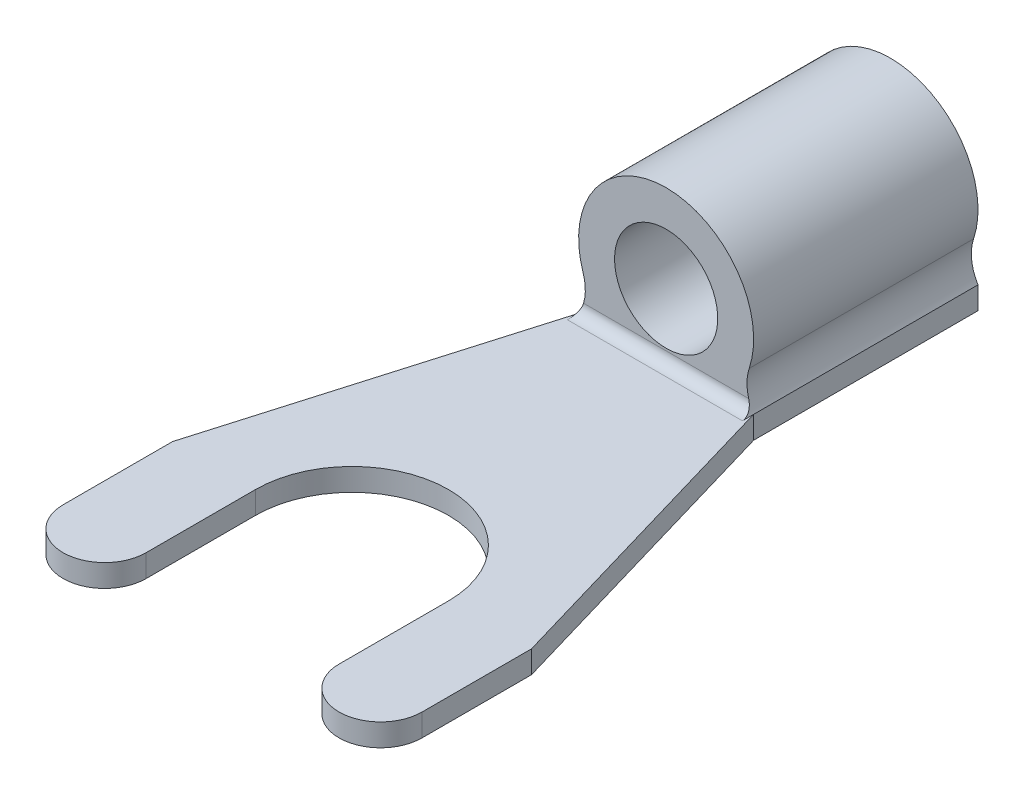
ISO-10303-21;
HEADER;
FILE_DESCRIPTION(('STEP AP214'),'2;1');
FILE_NAME('part.step','',(''),(''),'','','');
FILE_SCHEMA(('AUTOMOTIVE_DESIGN { 1 0 10303 214 1 1 1 1 }'));
ENDSEC;
DATA;
#1=APPLICATION_CONTEXT('core data for automotive mechanical design processes');
#2=APPLICATION_PROTOCOL_DEFINITION('international standard','automotive_design',2000,#1);
#3=PRODUCT_CONTEXT('',#1,'mechanical');
#4=PRODUCT('Part','Part','',(#3));
#5=PRODUCT_RELATED_PRODUCT_CATEGORY('part','',(#4));
#6=PRODUCT_DEFINITION_FORMATION('','',#4);
#7=PRODUCT_DEFINITION_CONTEXT('part definition',#1,'design');
#8=PRODUCT_DEFINITION('design','',#6,#7);
#9=PRODUCT_DEFINITION_SHAPE('','',#8);
#10=(LENGTH_UNIT() NAMED_UNIT(*) SI_UNIT(.MILLI.,.METRE.));
#11=(NAMED_UNIT(*) PLANE_ANGLE_UNIT() SI_UNIT($,.RADIAN.));
#12=(NAMED_UNIT(*) SI_UNIT($,.STERADIAN.) SOLID_ANGLE_UNIT());
#13=UNCERTAINTY_MEASURE_WITH_UNIT(LENGTH_MEASURE(1.E-05),#10,'distance_accuracy_value','');
#14=(GEOMETRIC_REPRESENTATION_CONTEXT(3) GLOBAL_UNCERTAINTY_ASSIGNED_CONTEXT((#13)) GLOBAL_UNIT_ASSIGNED_CONTEXT((#10,
#11,#12)) REPRESENTATION_CONTEXT('',''));
#15=CARTESIAN_POINT('',(0.,0.,0.));
#16=DIRECTION('',(0.,0.,1.));
#17=DIRECTION('',(1.,0.,0.));
#18=AXIS2_PLACEMENT_3D('',#15,#16,#17);
#19=CARTESIAN_POINT('',(-14.9500000000012,9.13000000000002,182.5));
#20=DIRECTION('',(-1.,0.,0.));
#21=DIRECTION('',(0.,0.,1.));
#22=AXIS2_PLACEMENT_3D('',#19,#20,#21);
#23=CYLINDRICAL_SURFACE('',#22,0.25);
#24=DIRECTION('',(-1.,0.,0.));
#25=VECTOR('',#24,1.);
#26=CARTESIAN_POINT('',(-14.9500000000012,9.13000000000002,182.25));
#27=LINE('',#26,#25);
#28=CARTESIAN_POINT('',(-13.1102982723098,9.13,182.25));
#29=VERTEX_POINT('',#28);
#30=CARTESIAN_POINT('',(-16.7897017276926,9.13000000000003,182.25));
#31=VERTEX_POINT('',#30);
#32=EDGE_CURVE('E155',#29,#31,#27,.T.);
#33=ORIENTED_EDGE('',*,*,#32,.T.);
#34=CARTESIAN_POINT('',(-16.9000000000012,8.88000000000003,182.5));
#35=CARTESIAN_POINT('',(-16.9000185220182,8.87998350208191,182.4872073478));
#36=CARTESIAN_POINT('',(-16.8993951977265,8.88098059979648,182.474436694274));
#37=CARTESIAN_POINT('',(-16.8970172730689,8.88485973144562,182.449364531361));
#38=CARTESIAN_POINT('',(-16.8952691101724,8.88773104058074,182.437060771608));
#39=CARTESIAN_POINT('',(-16.8907945553141,8.8952129119025,182.413214396754));
#40=CARTESIAN_POINT('',(-16.8880698056136,8.8998205548764,182.401670542118));
#41=CARTESIAN_POINT('',(-16.8818583154234,8.91058840206375,182.379542131342));
#42=CARTESIAN_POINT('',(-16.8783705728291,8.91675064972032,182.368958862934));
#43=CARTESIAN_POINT('',(-16.8705720409435,8.93095510962607,182.348173131809));
#44=CARTESIAN_POINT('',(-16.8662189837371,8.93910416134594,182.338059806611));
#45=CARTESIAN_POINT('',(-16.8571470031596,8.95676407682092,182.319291597628));
#46=CARTESIAN_POINT('',(-16.8524279042634,8.9662755957837,182.310637419929));
#47=CARTESIAN_POINT('',(-16.8422376060457,8.98776413334577,182.293899574314));
#48=CARTESIAN_POINT('',(-16.8367476004056,8.99990090788977,182.286031604488));
#49=CARTESIAN_POINT('',(-16.8258828243351,9.02538110219441,182.272485139351));
#50=CARTESIAN_POINT('',(-16.8205080070898,9.0387240197901,182.266805737989));
#51=CARTESIAN_POINT('',(-16.8106634813175,9.06487556374363,182.258282404753));
#52=CARTESIAN_POINT('',(-16.8061578831346,9.07759431701481,182.255204187879));
#53=CARTESIAN_POINT('',(-16.7975729816935,9.10350873376382,182.251059775299));
#54=CARTESIAN_POINT('',(-16.7934941515171,9.11670490512104,182.249995790551));
#55=CARTESIAN_POINT('',(-16.7897017276926,9.13000000000003,182.25));
#56=B_SPLINE_CURVE_WITH_KNOTS('',3,(#34,#35,#36,#37,#38,#39,#40,#41,#42,#43,#44,#45,#46,#47,#48,
#49,#50,#51,#52,#53,#54,#55),.UNSPECIFIED.,.F.,.F.,(4,2,2,2,2,2,2,2,2,2,4),(0.,
0.0382893069018446,0.0763614093332984,0.11436978653352,0.152428386377286,0.193361552979218,
0.234314470757116,0.28052232594922,0.326711030823076,0.368073046255073,0.409480437175439),.UNSPECIFIED.);
#57=CARTESIAN_POINT('',(-16.9000000000012,8.88000000000003,182.5));
#58=VERTEX_POINT('',#57);
#59=EDGE_CURVE('E40',#58,#31,#56,.T.);
#60=ORIENTED_EDGE('',*,*,#59,.F.);
#61=DIRECTION('',(1.,0.,0.));
#62=VECTOR('',#61,1.);
#63=CARTESIAN_POINT('',(-14.9500000000012,8.88000000000002,182.5));
#64=LINE('',#63,#62);
#65=CARTESIAN_POINT('',(-13.0000000000012,8.88,182.5));
#66=VERTEX_POINT('',#65);
#67=EDGE_CURVE('E152',#66,#58,#64,.F.);
#68=ORIENTED_EDGE('',*,*,#67,.F.);
#69=CARTESIAN_POINT('',(-13.1102982723098,9.13,182.25));
#70=CARTESIAN_POINT('',(-13.1060596798824,9.11512779679029,182.249993478925));
#71=CARTESIAN_POINT('',(-13.1014586294552,9.10038265994374,182.251325725585));
#72=CARTESIAN_POINT('',(-13.0917498699775,9.07155076728541,182.256491089866));
#73=CARTESIAN_POINT('',(-13.0866435145946,9.05746239360386,182.260317671396));
#74=CARTESIAN_POINT('',(-13.0761246940504,9.03028378413502,182.270290573388));
#75=CARTESIAN_POINT('',(-13.0707126184818,9.01719232577841,182.276433995671));
#76=CARTESIAN_POINT('',(-13.0598278133018,8.99226303979226,182.29086820397));
#77=CARTESIAN_POINT('',(-13.054355032871,8.98042636646853,182.299160943449));
#78=CARTESIAN_POINT('',(-13.0434334200001,8.95785141296547,182.318092214721));
#79=CARTESIAN_POINT('',(-13.037994126214,8.94717522708283,182.328810665518));
#80=CARTESIAN_POINT('',(-13.0277553318681,8.92780780539204,182.352187869189));
#81=CARTESIAN_POINT('',(-13.0229557967466,8.91911646233858,182.364846517168));
#82=CARTESIAN_POINT('',(-13.0146389486618,8.90444903830031,182.391175058417));
#83=CARTESIAN_POINT('',(-13.0110709798096,8.89836226630808,182.404766791729));
#84=CARTESIAN_POINT('',(-13.0053033009057,8.88866779343421,182.433062174529));
#85=CARTESIAN_POINT('',(-13.0030994657548,8.88505261502826,182.447762319456));
#86=CARTESIAN_POINT('',(-13.0011486699751,8.88186651093653,182.468873732107));
#87=CARTESIAN_POINT('',(-13.0007191109057,8.88116761544177,182.475071014027));
#88=CARTESIAN_POINT('',(-13.000144668019,8.88023447331087,182.487510768612));
#89=CARTESIAN_POINT('',(-12.9999996593873,8.88000002295155,182.493753220259));
#90=CARTESIAN_POINT('',(-13.0000000000012,8.88,182.5));
#91=B_SPLINE_CURVE_WITH_KNOTS('',3,(#69,#70,#71,#72,#73,#74,#75,#76,#77,#78,#79,#80,#81,#82,#83,
#84,#85,#86,#87,#88,#89,#90),.UNSPECIFIED.,.F.,.F.,(4,2,2,2,2,2,2,2,2,2,4),(0.,
0.0462989373863143,0.0924770392758468,0.138597566715191,0.18476015989698,0.232751610935645,
0.28074046827986,0.326416072227285,0.371952870975017,0.390686940772978,0.409412791278981),.UNSPECIFIED.);
#92=EDGE_CURVE('E160',#29,#66,#91,.T.);
#93=ORIENTED_EDGE('',*,*,#92,.F.);
#94=EDGE_LOOP('',(#33,#60,#68,#93));
#95=FACE_BOUND('',#94,.T.);
#96=ADVANCED_FACE('F36',(#95),#23,.F.);
#97=CARTESIAN_POINT('',(-14.9500000000012,10.33,182.25));
#98=DIRECTION('',(0.,0.,-1.));
#99=DIRECTION('',(-1.,0.,0.));
#100=AXIS2_PLACEMENT_3D('',#97,#98,#99);
#101=CYLINDRICAL_SURFACE('',#100,1.15);
#102=CARTESIAN_POINT('',(-14.9500000000012,10.33,177.600000000025));
#103=DIRECTION('',(0.,0.,-1.));
#104=DIRECTION('',(-1.,0.,0.));
#105=AXIS2_PLACEMENT_3D('',#102,#103,#104);
#106=CIRCLE('',#105,1.14999999999554);
#107=CARTESIAN_POINT('',(-16.0999999999967,10.33,177.600000000025));
#108=VERTEX_POINT('',#107);
#109=EDGE_CURVE('E244',#108,#108,#106,.T.);
#110=ORIENTED_EDGE('',*,*,#109,.T.);
#111=EDGE_LOOP('',(#110));
#112=FACE_BOUND('',#111,.T.);
#113=CARTESIAN_POINT('',(-14.9500000000012,10.33,182.25));
#114=DIRECTION('',(0.,0.,-1.));
#115=DIRECTION('',(-1.,0.,0.));
#116=AXIS2_PLACEMENT_3D('',#113,#114,#115);
#117=CIRCLE('',#116,1.15);
#118=CARTESIAN_POINT('',(-16.1000000000012,10.33,182.25));
#119=VERTEX_POINT('',#118);
#120=EDGE_CURVE('E170',#119,#119,#117,.F.);
#121=ORIENTED_EDGE('',*,*,#120,.T.);
#122=EDGE_LOOP('',(#121));
#123=FACE_BOUND('',#122,.T.);
#124=ADVANCED_FACE('F297',(#112,#123),#101,.F.);
#125=CARTESIAN_POINT('',(-14.9500000000012,10.33,182.25));
#126=DIRECTION('',(0.,0.,-1.));
#127=DIRECTION('',(-1.,0.,0.));
#128=AXIS2_PLACEMENT_3D('',#125,#126,#127);
#129=PLANE('',#128);
#130=ORIENTED_EDGE('',*,*,#120,.F.);
#131=EDGE_LOOP('',(#130));
#132=FACE_BOUND('',#131,.T.);
#133=ORIENTED_EDGE('',*,*,#32,.F.);
#134=CARTESIAN_POINT('',(-12.1488162453612,9.40486780796407,182.25));
#135=DIRECTION('',(0.,0.,1.));
#136=DIRECTION('',(1.,0.,0.));
#137=AXIS2_PLACEMENT_3D('',#134,#135,#136);
#138=CIRCLE('',#137,1.);
#139=CARTESIAN_POINT('',(-13.0983700604934,9.71847194085761,182.25));
#140=VERTEX_POINT('',#139);
#141=EDGE_CURVE('E211',#29,#140,#138,.F.);
#142=ORIENTED_EDGE('',*,*,#141,.T.);
#143=CARTESIAN_POINT('',(-14.9500000000012,10.33,182.25));
#144=DIRECTION('',(0.,0.,-1.));
#145=DIRECTION('',(-1.,0.,0.));
#146=AXIS2_PLACEMENT_3D('',#143,#144,#145);
#147=CIRCLE('',#146,1.95);
#148=CARTESIAN_POINT('',(-16.801629939509,9.71847194085765,182.25));
#149=VERTEX_POINT('',#148);
#150=EDGE_CURVE('E181',#149,#140,#147,.T.);
#151=ORIENTED_EDGE('',*,*,#150,.F.);
#152=CARTESIAN_POINT('',(-17.7511837546411,9.40486780796412,182.25));
#153=DIRECTION('',(0.,0.,-1.));
#154=DIRECTION('',(-1.,0.,0.));
#155=AXIS2_PLACEMENT_3D('',#152,#153,#154);
#156=CIRCLE('',#155,1.);
#157=EDGE_CURVE('E243',#31,#149,#156,.F.);
#158=ORIENTED_EDGE('',*,*,#157,.F.);
#159=EDGE_LOOP('',(#133,#142,#151,#158));
#160=FACE_BOUND('',#159,.T.);
#161=ADVANCED_FACE('F295',(#132,#160),#129,.F.);
#162=CARTESIAN_POINT('',(-14.9500000000012,8.88000000000002,189.25));
#163=DIRECTION('',(0.,1.,0.));
#164=DIRECTION('',(1.,0.,0.));
#165=AXIS2_PLACEMENT_3D('',#162,#163,#164);
#166=PLANE('',#165);
#167=DIRECTION('',(0.281052751161889,0.,0.959692321040621));
#168=VECTOR('',#167,1.);
#169=CARTESIAN_POINT('',(-11.2659625957439,8.87999999999998,188.17110333161));
#170=LINE('',#169,#168);
#171=CARTESIAN_POINT('',(-10.9500000000012,8.87999999999998,189.25));
#172=VERTEX_POINT('',#171);
#173=CARTESIAN_POINT('',(-13.0000000000012,8.88,182.25));
#174=VERTEX_POINT('',#173);
#175=EDGE_CURVE('E217',#172,#174,#170,.F.);
#176=ORIENTED_EDGE('',*,*,#175,.T.);
#177=DIRECTION('',(0.,0.,1.));
#178=VECTOR('',#177,1.);
#179=CARTESIAN_POINT('',(-13.0000000000012,8.88,189.25));
#180=LINE('',#179,#178);
#181=EDGE_CURVE('E168',#174,#66,#180,.T.);
#182=ORIENTED_EDGE('',*,*,#181,.T.);
#183=ORIENTED_EDGE('',*,*,#67,.T.);
#184=DIRECTION('',(0.,0.,-1.));
#185=VECTOR('',#184,1.);
#186=CARTESIAN_POINT('',(-16.9000000000012,8.88000000000003,189.25));
#187=LINE('',#186,#185);
#188=CARTESIAN_POINT('',(-16.9000000000012,8.88000000000003,182.25));
#189=VERTEX_POINT('',#188);
#190=EDGE_CURVE('E166',#58,#189,#187,.T.);
#191=ORIENTED_EDGE('',*,*,#190,.T.);
#192=DIRECTION('',(0.281052751161902,0.,-0.959692321040617));
#193=VECTOR('',#192,1.);
#194=CARTESIAN_POINT('',(-18.6340374042586,8.88000000000005,188.17110333161));
#195=LINE('',#194,#193);
#196=CARTESIAN_POINT('',(-18.9500000000012,8.88000000000005,189.25));
#197=VERTEX_POINT('',#196);
#198=EDGE_CURVE('E175',#189,#197,#195,.F.);
#199=ORIENTED_EDGE('',*,*,#198,.T.);
#200=DIRECTION('',(0.,0.,1.));
#201=VECTOR('',#200,1.);
#202=CARTESIAN_POINT('',(-18.9500000000012,8.88000000000005,189.25));
#203=LINE('',#202,#201);
#204=CARTESIAN_POINT('',(-18.9500000000013,8.88000000000005,191.68926218353));
#205=VERTEX_POINT('',#204);
#206=EDGE_CURVE('E178',#205,#197,#203,.F.);
#207=ORIENTED_EDGE('',*,*,#206,.F.);
#208=CARTESIAN_POINT('',(-18.0250000000013,8.88000000000004,191.68926218353));
#209=DIRECTION('',(0.,-1.,0.));
#210=DIRECTION('',(-1.,0.,0.));
#211=AXIS2_PLACEMENT_3D('',#208,#209,#210);
#212=CIRCLE('',#211,0.925);
#213=CARTESIAN_POINT('',(-17.1000000000013,8.88000000000004,191.68926218353));
#214=VERTEX_POINT('',#213);
#215=EDGE_CURVE('E273',#214,#205,#212,.T.);
#216=ORIENTED_EDGE('',*,*,#215,.F.);
#217=DIRECTION('',(0.,0.,-1.));
#218=VECTOR('',#217,1.);
#219=CARTESIAN_POINT('',(-17.1000000000012,8.88000000000004,189.25));
#220=LINE('',#219,#218);
#221=CARTESIAN_POINT('',(-17.1000000000012,8.88000000000004,189.25));
#222=VERTEX_POINT('',#221);
#223=EDGE_CURVE('E234',#222,#214,#220,.F.);
#224=ORIENTED_EDGE('',*,*,#223,.F.);
#225=CARTESIAN_POINT('',(-14.9500000000012,8.88000000000002,189.25));
#226=DIRECTION('',(0.,-1.,0.));
#227=DIRECTION('',(-1.,0.,0.));
#228=AXIS2_PLACEMENT_3D('',#225,#226,#227);
#229=CIRCLE('',#228,2.15);
#230=CARTESIAN_POINT('',(-12.8000000000013,8.88,189.25));
#231=VERTEX_POINT('',#230);
#232=EDGE_CURVE('E270',#222,#231,#229,.T.);
#233=ORIENTED_EDGE('',*,*,#232,.T.);
#234=DIRECTION('',(0.,0.,-1.));
#235=VECTOR('',#234,1.);
#236=CARTESIAN_POINT('',(-12.8000000000013,8.88,189.25));
#237=LINE('',#236,#235);
#238=CARTESIAN_POINT('',(-12.8000000000013,8.88,191.68926218353));
#239=VERTEX_POINT('',#238);
#240=EDGE_CURVE('E229',#231,#239,#237,.F.);
#241=ORIENTED_EDGE('',*,*,#240,.T.);
#242=CARTESIAN_POINT('',(-11.8750000000013,8.87999999999999,191.68926218353));
#243=DIRECTION('',(0.,-1.,0.));
#244=DIRECTION('',(-1.,0.,0.));
#245=AXIS2_PLACEMENT_3D('',#242,#243,#244);
#246=CIRCLE('',#245,0.925);
#247=CARTESIAN_POINT('',(-10.9500000000013,8.87999999999998,191.68926218353));
#248=VERTEX_POINT('',#247);
#249=EDGE_CURVE('E232',#248,#239,#246,.T.);
#250=ORIENTED_EDGE('',*,*,#249,.F.);
#251=DIRECTION('',(0.,0.,1.));
#252=VECTOR('',#251,1.);
#253=CARTESIAN_POINT('',(-10.9500000000012,8.87999999999998,189.25));
#254=LINE('',#253,#252);
#255=EDGE_CURVE('E224',#248,#172,#254,.F.);
#256=ORIENTED_EDGE('',*,*,#255,.T.);
#257=EDGE_LOOP('',(#176,#182,#183,#191,#199,#207,#216,#224,#233,#241,#250,#256));
#258=FACE_BOUND('',#257,.T.);
#259=ADVANCED_FACE('F164',(#258),#166,.T.);
#260=CARTESIAN_POINT('',(-12.1488162453613,9.40486780796407,189.25));
#261=DIRECTION('',(0.,0.,1.));
#262=DIRECTION('',(1.,0.,0.));
#263=AXIS2_PLACEMENT_3D('',#260,#261,#262);
#264=CYLINDRICAL_SURFACE('',#263,1.);
#265=ORIENTED_EDGE('',*,*,#92,.T.);
#266=ORIENTED_EDGE('',*,*,#181,.F.);
#267=DIRECTION('',(0.,0.,1.));
#268=VECTOR('',#267,1.);
#269=CARTESIAN_POINT('',(-13.0000000000012,8.88,189.25));
#270=LINE('',#269,#268);
#271=CARTESIAN_POINT('',(-13.0000000000011,8.88,177.25));
#272=VERTEX_POINT('',#271);
#273=EDGE_CURVE('E198',#174,#272,#270,.F.);
#274=ORIENTED_EDGE('',*,*,#273,.T.);
#275=CARTESIAN_POINT('',(-12.1488162453612,9.40486780796407,177.25));
#276=DIRECTION('',(0.,0.,1.));
#277=DIRECTION('',(1.,0.,0.));
#278=AXIS2_PLACEMENT_3D('',#275,#276,#277);
#279=CIRCLE('',#278,1.);
#280=CARTESIAN_POINT('',(-13.0983700604934,9.71847194085761,177.25));
#281=VERTEX_POINT('',#280);
#282=EDGE_CURVE('E212',#281,#272,#279,.T.);
#283=ORIENTED_EDGE('',*,*,#282,.F.);
#284=DIRECTION('',(0.,0.,1.));
#285=VECTOR('',#284,1.);
#286=CARTESIAN_POINT('',(-13.0983700604935,9.71847194085761,189.25));
#287=LINE('',#286,#285);
#288=EDGE_CURVE('E169',#140,#281,#287,.F.);
#289=ORIENTED_EDGE('',*,*,#288,.F.);
#290=ORIENTED_EDGE('',*,*,#141,.F.);
#291=EDGE_LOOP('',(#265,#266,#274,#283,#289,#290));
#292=FACE_BOUND('',#291,.T.);
#293=ADVANCED_FACE('F285',(#292),#264,.F.);
#294=CARTESIAN_POINT('',(-14.9500000000011,10.33,177.250000000056));
#295=DIRECTION('',(0.,0.,-1.));
#296=DIRECTION('',(-1.,0.,0.));
#297=AXIS2_PLACEMENT_3D('',#294,#295,#296);
#298=CONICAL_SURFACE('',#297,1.49999999996453,0.785398163397448);
#299=CARTESIAN_POINT('',(-14.9500000000011,10.33,177.249999999999));
#300=DIRECTION('',(0.,0.,-1.));
#301=DIRECTION('',(-1.,0.,0.));
#302=AXIS2_PLACEMENT_3D('',#299,#300,#301);
#303=CIRCLE('',#302,1.50000000002137);
#304=CARTESIAN_POINT('',(-16.4500000000225,10.33,177.249999999999));
#305=VERTEX_POINT('',#304);
#306=EDGE_CURVE('E201',#305,#305,#303,.T.);
#307=ORIENTED_EDGE('',*,*,#306,.T.);
#308=EDGE_LOOP('',(#307));
#309=FACE_BOUND('',#308,.T.);
#310=ORIENTED_EDGE('',*,*,#109,.F.);
#311=EDGE_LOOP('',(#310));
#312=FACE_BOUND('',#311,.T.);
#313=ADVANCED_FACE('F290',(#309,#312),#298,.F.);
#314=CARTESIAN_POINT('',(-14.9500000000012,10.33,182.25));
#315=DIRECTION('',(0.,0.,-1.));
#316=DIRECTION('',(-1.,0.,0.));
#317=AXIS2_PLACEMENT_3D('',#314,#315,#316);
#318=CYLINDRICAL_SURFACE('',#317,1.95);
#319=CARTESIAN_POINT('',(-14.9500000000011,10.33,177.25));
#320=DIRECTION('',(0.,0.,-1.));
#321=DIRECTION('',(-1.,0.,0.));
#322=AXIS2_PLACEMENT_3D('',#319,#320,#321);
#323=CIRCLE('',#322,1.95);
#324=CARTESIAN_POINT('',(-16.8016299395089,9.71847194085765,177.25));
#325=VERTEX_POINT('',#324);
#326=EDGE_CURVE('E263',#281,#325,#323,.F.);
#327=ORIENTED_EDGE('',*,*,#326,.T.);
#328=DIRECTION('',(0.,0.,-1.));
#329=VECTOR('',#328,1.);
#330=CARTESIAN_POINT('',(-16.801629939509,9.71847194085765,189.25));
#331=LINE('',#330,#329);
#332=EDGE_CURVE('E176',#325,#149,#331,.F.);
#333=ORIENTED_EDGE('',*,*,#332,.T.);
#334=ORIENTED_EDGE('',*,*,#150,.T.);
#335=ORIENTED_EDGE('',*,*,#288,.T.);
#336=EDGE_LOOP('',(#327,#333,#334,#335));
#337=FACE_BOUND('',#336,.T.);
#338=ADVANCED_FACE('F361',(#337),#318,.T.);
#339=CARTESIAN_POINT('',(-17.7511837546412,9.40486780796412,189.25));
#340=DIRECTION('',(0.,0.,-1.));
#341=DIRECTION('',(-1.,0.,0.));
#342=AXIS2_PLACEMENT_3D('',#339,#340,#341);
#343=CYLINDRICAL_SURFACE('',#342,1.);
#344=DIRECTION('',(0.,0.,-1.));
#345=VECTOR('',#344,1.);
#346=CARTESIAN_POINT('',(-16.9000000000012,8.88000000000003,189.25));
#347=LINE('',#346,#345);
#348=CARTESIAN_POINT('',(-16.9000000000012,8.88000000000003,177.25));
#349=VERTEX_POINT('',#348);
#350=EDGE_CURVE('E174',#349,#189,#347,.F.);
#351=ORIENTED_EDGE('',*,*,#350,.T.);
#352=ORIENTED_EDGE('',*,*,#190,.F.);
#353=ORIENTED_EDGE('',*,*,#59,.T.);
#354=ORIENTED_EDGE('',*,*,#157,.T.);
#355=ORIENTED_EDGE('',*,*,#332,.F.);
#356=CARTESIAN_POINT('',(-17.7511837546411,9.40486780796412,177.25));
#357=DIRECTION('',(0.,0.,-1.));
#358=DIRECTION('',(-1.,0.,0.));
#359=AXIS2_PLACEMENT_3D('',#356,#357,#358);
#360=CIRCLE('',#359,1.);
#361=EDGE_CURVE('E190',#325,#349,#360,.T.);
#362=ORIENTED_EDGE('',*,*,#361,.T.);
#363=EDGE_LOOP('',(#351,#352,#353,#354,#355,#362));
#364=FACE_BOUND('',#363,.T.);
#365=ADVANCED_FACE('F173',(#364),#343,.F.);
#366=CARTESIAN_POINT('',(-18.6340374042586,8.88000000000005,188.17110333161));
#367=DIRECTION('',(0.959692321040617,0.,0.281052751161902));
#368=DIRECTION('',(0.281052751161902,0.,-0.959692321040617));
#369=AXIS2_PLACEMENT_3D('',#366,#367,#368);
#370=PLANE('',#369);
#371=DIRECTION('',(0.,1.,0.));
#372=VECTOR('',#371,1.);
#373=CARTESIAN_POINT('',(-18.9500000000012,8.88000000000005,189.25));
#374=LINE('',#373,#372);
#375=CARTESIAN_POINT('',(-18.9500000000012,8.38000000000005,189.25));
#376=VERTEX_POINT('',#375);
#377=EDGE_CURVE('E239',#197,#376,#374,.F.);
#378=ORIENTED_EDGE('',*,*,#377,.F.);
#379=ORIENTED_EDGE('',*,*,#198,.F.);
#380=DIRECTION('',(0.,1.,0.));
#381=VECTOR('',#380,1.);
#382=CARTESIAN_POINT('',(-16.9000000000012,8.88000000000003,182.25));
#383=LINE('',#382,#381);
#384=CARTESIAN_POINT('',(-16.9000000000012,8.38000000000003,182.25));
#385=VERTEX_POINT('',#384);
#386=EDGE_CURVE('E406',#189,#385,#383,.F.);
#387=ORIENTED_EDGE('',*,*,#386,.T.);
#388=DIRECTION('',(-0.281052751161902,0.,0.959692321040617));
#389=VECTOR('',#388,1.);
#390=CARTESIAN_POINT('',(-16.9000000000012,8.38000000000003,182.25));
#391=LINE('',#390,#389);
#392=EDGE_CURVE('E403',#385,#376,#391,.T.);
#393=ORIENTED_EDGE('',*,*,#392,.T.);
#394=EDGE_LOOP('',(#378,#379,#387,#393));
#395=FACE_BOUND('',#394,.T.);
#396=ADVANCED_FACE('F355',(#395),#370,.F.);
#397=CARTESIAN_POINT('',(-18.9500000000012,8.88000000000005,189.25));
#398=DIRECTION('',(-1.,0.,0.));
#399=DIRECTION('',(0.,0.,1.));
#400=AXIS2_PLACEMENT_3D('',#397,#398,#399);
#401=PLANE('',#400);
#402=ORIENTED_EDGE('',*,*,#206,.T.);
#403=ORIENTED_EDGE('',*,*,#377,.T.);
#404=DIRECTION('',(0.,0.,-1.));
#405=VECTOR('',#404,1.);
#406=CARTESIAN_POINT('',(-18.9500000000012,8.38000000000005,189.25));
#407=LINE('',#406,#405);
#408=CARTESIAN_POINT('',(-18.9500000000013,8.38000000000005,191.68926218353));
#409=VERTEX_POINT('',#408);
#410=EDGE_CURVE('E261',#376,#409,#407,.F.);
#411=ORIENTED_EDGE('',*,*,#410,.T.);
#412=DIRECTION('',(0.,-1.,0.));
#413=VECTOR('',#412,1.);
#414=CARTESIAN_POINT('',(-18.9500000000013,8.88000000000005,191.68926218353));
#415=LINE('',#414,#413);
#416=EDGE_CURVE('E237',#205,#409,#415,.T.);
#417=ORIENTED_EDGE('',*,*,#416,.F.);
#418=EDGE_LOOP('',(#402,#403,#411,#417));
#419=FACE_BOUND('',#418,.T.);
#420=ADVANCED_FACE('F351',(#419),#401,.T.);
#421=CARTESIAN_POINT('',(-18.0250000000013,8.88000000000004,191.68926218353));
#422=DIRECTION('',(0.,-1.,0.));
#423=DIRECTION('',(-1.,0.,0.));
#424=AXIS2_PLACEMENT_3D('',#421,#422,#423);
#425=CYLINDRICAL_SURFACE('',#424,0.925);
#426=ORIENTED_EDGE('',*,*,#215,.T.);
#427=ORIENTED_EDGE('',*,*,#416,.T.);
#428=CARTESIAN_POINT('',(-18.0250000000013,8.38000000000004,191.68926218353));
#429=DIRECTION('',(0.,-1.,0.));
#430=DIRECTION('',(-1.,0.,0.));
#431=AXIS2_PLACEMENT_3D('',#428,#429,#430);
#432=CIRCLE('',#431,0.925);
#433=CARTESIAN_POINT('',(-17.1000000000013,8.38000000000003,191.68926218353));
#434=VERTEX_POINT('',#433);
#435=EDGE_CURVE('E258',#409,#434,#432,.F.);
#436=ORIENTED_EDGE('',*,*,#435,.T.);
#437=DIRECTION('',(0.,1.,0.));
#438=VECTOR('',#437,1.);
#439=CARTESIAN_POINT('',(-17.1000000000013,8.88000000000004,191.68926218353));
#440=LINE('',#439,#438);
#441=EDGE_CURVE('E236',#214,#434,#440,.F.);
#442=ORIENTED_EDGE('',*,*,#441,.F.);
#443=EDGE_LOOP('',(#426,#427,#436,#442));
#444=FACE_BOUND('',#443,.T.);
#445=ADVANCED_FACE('F347',(#444),#425,.T.);
#446=CARTESIAN_POINT('',(-17.1000000000012,8.88000000000004,189.25));
#447=DIRECTION('',(1.,0.,0.));
#448=DIRECTION('',(0.,0.,-1.));
#449=AXIS2_PLACEMENT_3D('',#446,#447,#448);
#450=PLANE('',#449);
#451=ORIENTED_EDGE('',*,*,#223,.T.);
#452=ORIENTED_EDGE('',*,*,#441,.T.);
#453=DIRECTION('',(0.,0.,-1.));
#454=VECTOR('',#453,1.);
#455=CARTESIAN_POINT('',(-17.1000000000012,8.38000000000003,189.25));
#456=LINE('',#455,#454);
#457=CARTESIAN_POINT('',(-17.1000000000012,8.38000000000003,189.25));
#458=VERTEX_POINT('',#457);
#459=EDGE_CURVE('E257',#434,#458,#456,.T.);
#460=ORIENTED_EDGE('',*,*,#459,.T.);
#461=DIRECTION('',(0.,-1.,0.));
#462=VECTOR('',#461,1.);
#463=CARTESIAN_POINT('',(-17.1000000000012,8.88000000000004,189.25));
#464=LINE('',#463,#462);
#465=EDGE_CURVE('E272',#458,#222,#464,.F.);
#466=ORIENTED_EDGE('',*,*,#465,.T.);
#467=EDGE_LOOP('',(#451,#452,#460,#466));
#468=FACE_BOUND('',#467,.T.);
#469=ADVANCED_FACE('F343',(#468),#450,.T.);
#470=CARTESIAN_POINT('',(-14.9500000000012,8.88000000000002,189.25));
#471=DIRECTION('',(0.,-1.,0.));
#472=DIRECTION('',(-1.,0.,0.));
#473=AXIS2_PLACEMENT_3D('',#470,#471,#472);
#474=CYLINDRICAL_SURFACE('',#473,2.15);
#475=DIRECTION('',(0.,1.,0.));
#476=VECTOR('',#475,1.);
#477=CARTESIAN_POINT('',(-12.8000000000013,8.88,189.25));
#478=LINE('',#477,#476);
#479=CARTESIAN_POINT('',(-12.8000000000013,8.38,189.25));
#480=VERTEX_POINT('',#479);
#481=EDGE_CURVE('E233',#480,#231,#478,.T.);
#482=ORIENTED_EDGE('',*,*,#481,.T.);
#483=ORIENTED_EDGE('',*,*,#232,.F.);
#484=ORIENTED_EDGE('',*,*,#465,.F.);
#485=CARTESIAN_POINT('',(-14.9500000000012,8.38000000000002,189.25));
#486=DIRECTION('',(0.,-1.,0.));
#487=DIRECTION('',(-1.,0.,0.));
#488=AXIS2_PLACEMENT_3D('',#485,#486,#487);
#489=CIRCLE('',#488,2.15);
#490=EDGE_CURVE('E254',#458,#480,#489,.T.);
#491=ORIENTED_EDGE('',*,*,#490,.T.);
#492=EDGE_LOOP('',(#482,#483,#484,#491));
#493=FACE_BOUND('',#492,.T.);
#494=ADVANCED_FACE('F339',(#493),#474,.F.);
#495=CARTESIAN_POINT('',(-12.8000000000013,8.88,189.25));
#496=DIRECTION('',(1.,0.,0.));
#497=DIRECTION('',(0.,0.,-1.));
#498=AXIS2_PLACEMENT_3D('',#495,#496,#497);
#499=PLANE('',#498);
#500=DIRECTION('',(0.,-1.,0.));
#501=VECTOR('',#500,1.);
#502=CARTESIAN_POINT('',(-12.8000000000013,8.88,191.68926218353));
#503=LINE('',#502,#501);
#504=CARTESIAN_POINT('',(-12.8000000000013,8.38,191.68926218353));
#505=VERTEX_POINT('',#504);
#506=EDGE_CURVE('E269',#239,#505,#503,.T.);
#507=ORIENTED_EDGE('',*,*,#506,.F.);
#508=ORIENTED_EDGE('',*,*,#240,.F.);
#509=ORIENTED_EDGE('',*,*,#481,.F.);
#510=DIRECTION('',(0.,0.,-1.));
#511=VECTOR('',#510,1.);
#512=CARTESIAN_POINT('',(-12.8000000000013,8.38,189.25));
#513=LINE('',#512,#511);
#514=EDGE_CURVE('E253',#480,#505,#513,.F.);
#515=ORIENTED_EDGE('',*,*,#514,.T.);
#516=EDGE_LOOP('',(#507,#508,#509,#515));
#517=FACE_BOUND('',#516,.T.);
#518=ADVANCED_FACE('F335',(#517),#499,.F.);
#519=CARTESIAN_POINT('',(-11.8750000000013,8.87999999999999,191.68926218353));
#520=DIRECTION('',(0.,-1.,0.));
#521=DIRECTION('',(-1.,0.,0.));
#522=AXIS2_PLACEMENT_3D('',#519,#520,#521);
#523=CYLINDRICAL_SURFACE('',#522,0.925);
#524=ORIENTED_EDGE('',*,*,#249,.T.);
#525=ORIENTED_EDGE('',*,*,#506,.T.);
#526=CARTESIAN_POINT('',(-11.8750000000013,8.37999999999999,191.68926218353));
#527=DIRECTION('',(0.,-1.,0.));
#528=DIRECTION('',(-1.,0.,0.));
#529=AXIS2_PLACEMENT_3D('',#526,#527,#528);
#530=CIRCLE('',#529,0.925);
#531=CARTESIAN_POINT('',(-10.9500000000013,8.37999999999998,191.68926218353));
#532=VERTEX_POINT('',#531);
#533=EDGE_CURVE('E249',#505,#532,#530,.F.);
#534=ORIENTED_EDGE('',*,*,#533,.T.);
#535=DIRECTION('',(0.,1.,0.));
#536=VECTOR('',#535,1.);
#537=CARTESIAN_POINT('',(-10.9500000000013,8.87999999999998,191.68926218353));
#538=LINE('',#537,#536);
#539=EDGE_CURVE('E226',#532,#248,#538,.T.);
#540=ORIENTED_EDGE('',*,*,#539,.T.);
#541=EDGE_LOOP('',(#524,#525,#534,#540));
#542=FACE_BOUND('',#541,.T.);
#543=ADVANCED_FACE('F331',(#542),#523,.T.);
#544=CARTESIAN_POINT('',(-10.9500000000012,8.87999999999998,189.25));
#545=DIRECTION('',(-1.,0.,0.));
#546=DIRECTION('',(0.,0.,1.));
#547=AXIS2_PLACEMENT_3D('',#544,#545,#546);
#548=PLANE('',#547);
#549=DIRECTION('',(0.,1.,0.));
#550=VECTOR('',#549,1.);
#551=CARTESIAN_POINT('',(-10.9500000000012,8.87999999999998,189.25));
#552=LINE('',#551,#550);
#553=CARTESIAN_POINT('',(-10.9500000000012,8.37999999999998,189.25));
#554=VERTEX_POINT('',#553);
#555=EDGE_CURVE('E221',#554,#172,#552,.T.);
#556=ORIENTED_EDGE('',*,*,#555,.T.);
#557=ORIENTED_EDGE('',*,*,#255,.F.);
#558=ORIENTED_EDGE('',*,*,#539,.F.);
#559=DIRECTION('',(0.,0.,-1.));
#560=VECTOR('',#559,1.);
#561=CARTESIAN_POINT('',(-10.9500000000012,8.37999999999998,189.25));
#562=LINE('',#561,#560);
#563=EDGE_CURVE('E252',#532,#554,#562,.T.);
#564=ORIENTED_EDGE('',*,*,#563,.T.);
#565=EDGE_LOOP('',(#556,#557,#558,#564));
#566=FACE_BOUND('',#565,.T.);
#567=ADVANCED_FACE('F327',(#566),#548,.F.);
#568=CARTESIAN_POINT('',(-11.2659625957439,8.87999999999998,188.17110333161));
#569=DIRECTION('',(-0.959692321040621,0.,0.281052751161889));
#570=DIRECTION('',(0.281052751161889,0.,0.959692321040621));
#571=AXIS2_PLACEMENT_3D('',#568,#569,#570);
#572=PLANE('',#571);
#573=DIRECTION('',(0.,1.,0.));
#574=VECTOR('',#573,1.);
#575=CARTESIAN_POINT('',(-13.0000000000012,8.88,182.25));
#576=LINE('',#575,#574);
#577=CARTESIAN_POINT('',(-13.0000000000012,8.38,182.25));
#578=VERTEX_POINT('',#577);
#579=EDGE_CURVE('E202',#578,#174,#576,.T.);
#580=ORIENTED_EDGE('',*,*,#579,.T.);
#581=ORIENTED_EDGE('',*,*,#175,.F.);
#582=ORIENTED_EDGE('',*,*,#555,.F.);
#583=DIRECTION('',(-0.281052751161889,0.,-0.959692321040621));
#584=VECTOR('',#583,1.);
#585=CARTESIAN_POINT('',(-10.9500000000012,8.37999999999998,189.25));
#586=LINE('',#585,#584);
#587=EDGE_CURVE('E207',#554,#578,#586,.T.);
#588=ORIENTED_EDGE('',*,*,#587,.T.);
#589=EDGE_LOOP('',(#580,#581,#582,#588));
#590=FACE_BOUND('',#589,.T.);
#591=ADVANCED_FACE('F323',(#590),#572,.F.);
#592=CARTESIAN_POINT('',(-13.0000000000012,8.88,189.25));
#593=DIRECTION('',(-1.,0.,0.));
#594=DIRECTION('',(0.,0.,1.));
#595=AXIS2_PLACEMENT_3D('',#592,#593,#594);
#596=PLANE('',#595);
#597=DIRECTION('',(0.,1.,0.));
#598=VECTOR('',#597,1.);
#599=CARTESIAN_POINT('',(-13.0000000000011,8.88,177.25));
#600=LINE('',#599,#598);
#601=CARTESIAN_POINT('',(-13.0000000000011,8.38,177.25));
#602=VERTEX_POINT('',#601);
#603=EDGE_CURVE('E265',#602,#272,#600,.T.);
#604=ORIENTED_EDGE('',*,*,#603,.T.);
#605=ORIENTED_EDGE('',*,*,#273,.F.);
#606=ORIENTED_EDGE('',*,*,#579,.F.);
#607=DIRECTION('',(0.,0.,-1.));
#608=VECTOR('',#607,1.);
#609=CARTESIAN_POINT('',(-13.0000000000012,8.38,189.25));
#610=LINE('',#609,#608);
#611=EDGE_CURVE('E195',#578,#602,#610,.T.);
#612=ORIENTED_EDGE('',*,*,#611,.T.);
#613=EDGE_LOOP('',(#604,#605,#606,#612));
#614=FACE_BOUND('',#613,.T.);
#615=ADVANCED_FACE('F319',(#614),#596,.F.);
#616=CARTESIAN_POINT('',(-14.9500000000012,8.88000000000002,177.25));
#617=DIRECTION('',(0.,0.,1.));
#618=DIRECTION('',(1.,0.,0.));
#619=AXIS2_PLACEMENT_3D('',#616,#617,#618);
#620=PLANE('',#619);
#621=DIRECTION('',(0.,1.,0.));
#622=VECTOR('',#621,1.);
#623=CARTESIAN_POINT('',(-16.9000000000012,8.88000000000003,177.25));
#624=LINE('',#623,#622);
#625=CARTESIAN_POINT('',(-16.9000000000012,8.38000000000003,177.25));
#626=VERTEX_POINT('',#625);
#627=EDGE_CURVE('E58',#626,#349,#624,.T.);
#628=ORIENTED_EDGE('',*,*,#627,.T.);
#629=ORIENTED_EDGE('',*,*,#361,.F.);
#630=ORIENTED_EDGE('',*,*,#326,.F.);
#631=ORIENTED_EDGE('',*,*,#282,.T.);
#632=ORIENTED_EDGE('',*,*,#603,.F.);
#633=DIRECTION('',(1.,0.,0.));
#634=VECTOR('',#633,1.);
#635=CARTESIAN_POINT('',(-14.9500000000012,8.38000000000002,177.25));
#636=LINE('',#635,#634);
#637=EDGE_CURVE('E50',#602,#626,#636,.F.);
#638=ORIENTED_EDGE('',*,*,#637,.T.);
#639=EDGE_LOOP('',(#628,#629,#630,#631,#632,#638));
#640=FACE_BOUND('',#639,.T.);
#641=ORIENTED_EDGE('',*,*,#306,.F.);
#642=EDGE_LOOP('',(#641));
#643=FACE_BOUND('',#642,.T.);
#644=ADVANCED_FACE('F313',(#640,#643),#620,.F.);
#645=CARTESIAN_POINT('',(-16.9000000000012,8.88000000000003,189.25));
#646=DIRECTION('',(1.,0.,0.));
#647=DIRECTION('',(0.,0.,-1.));
#648=AXIS2_PLACEMENT_3D('',#645,#646,#647);
#649=PLANE('',#648);
#650=ORIENTED_EDGE('',*,*,#386,.F.);
#651=ORIENTED_EDGE('',*,*,#350,.F.);
#652=ORIENTED_EDGE('',*,*,#627,.F.);
#653=DIRECTION('',(0.,0.,-1.));
#654=VECTOR('',#653,1.);
#655=CARTESIAN_POINT('',(-16.9000000000012,8.38000000000003,189.25));
#656=LINE('',#655,#654);
#657=EDGE_CURVE('E11',#626,#385,#656,.F.);
#658=ORIENTED_EDGE('',*,*,#657,.T.);
#659=EDGE_LOOP('',(#650,#651,#652,#658));
#660=FACE_BOUND('',#659,.T.);
#661=ADVANCED_FACE('F307',(#660),#649,.F.);
#662=CARTESIAN_POINT('',(-14.9500000000012,8.38000000000002,189.25));
#663=DIRECTION('',(0.,1.,0.));
#664=DIRECTION('',(1.,0.,0.));
#665=AXIS2_PLACEMENT_3D('',#662,#663,#664);
#666=PLANE('',#665);
#667=ORIENTED_EDGE('',*,*,#637,.F.);
#668=ORIENTED_EDGE('',*,*,#611,.F.);
#669=ORIENTED_EDGE('',*,*,#587,.F.);
#670=ORIENTED_EDGE('',*,*,#563,.F.);
#671=ORIENTED_EDGE('',*,*,#533,.F.);
#672=ORIENTED_EDGE('',*,*,#514,.F.);
#673=ORIENTED_EDGE('',*,*,#490,.F.);
#674=ORIENTED_EDGE('',*,*,#459,.F.);
#675=ORIENTED_EDGE('',*,*,#435,.F.);
#676=ORIENTED_EDGE('',*,*,#410,.F.);
#677=ORIENTED_EDGE('',*,*,#392,.F.);
#678=ORIENTED_EDGE('',*,*,#657,.F.);
#679=EDGE_LOOP('',(#667,#668,#669,#670,#671,#672,#673,#674,#675,#676,#677,#678));
#680=FACE_BOUND('',#679,.T.);
#681=ADVANCED_FACE('F305',(#680),#666,.F.);
#682=CLOSED_SHELL('',(#96,#124,#161,#259,#293,#313,#338,#365,#396,#420,#445,#469,#494,#518,#543,
#567,#591,#615,#644,#661,#681));
#683=MANIFOLD_SOLID_BREP('B2',#682);
#684=ADVANCED_BREP_SHAPE_REPRESENTATION('',(#18,#683),#14);
#685=SHAPE_DEFINITION_REPRESENTATION(#9,#684);
ENDSEC;
END-ISO-10303-21;
